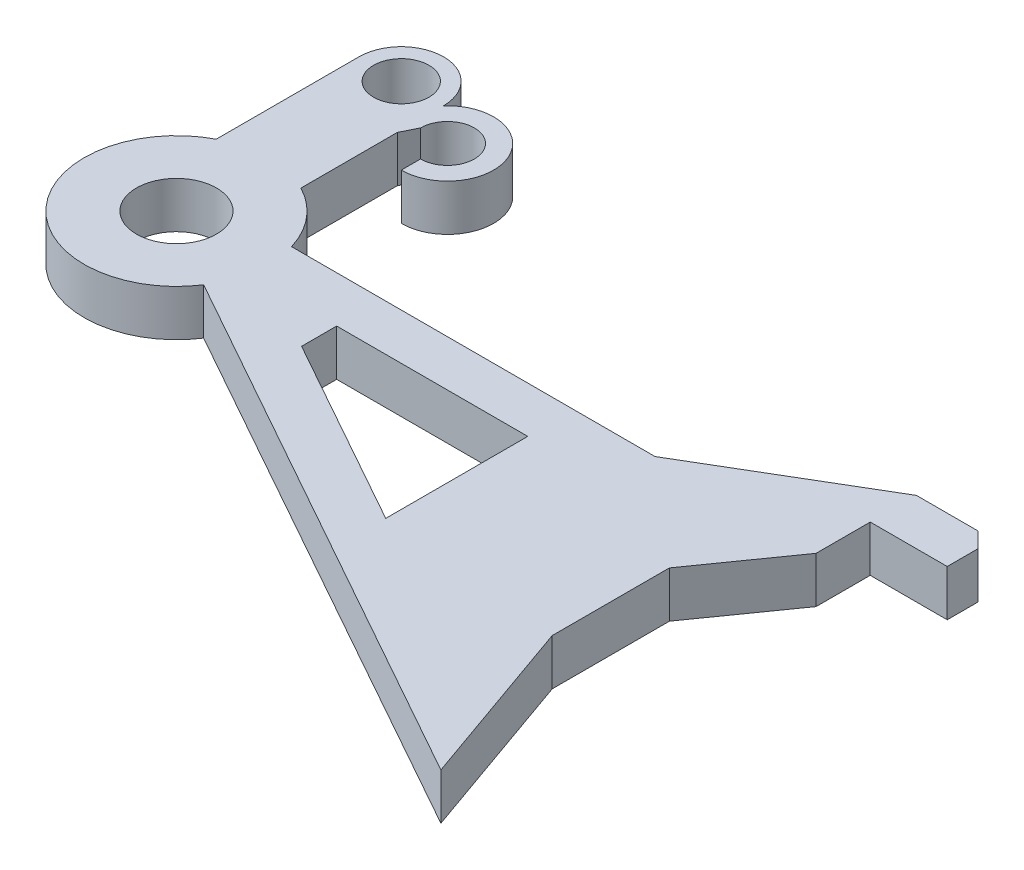
ISO-10303-21;
HEADER;
FILE_DESCRIPTION(('STEP AP214'),'2;1');
FILE_NAME('part.step','',(''),(''),'','','');
FILE_SCHEMA(('AUTOMOTIVE_DESIGN { 1 0 10303 214 1 1 1 1 }'));
ENDSEC;
DATA;
#1=APPLICATION_CONTEXT('core data for automotive mechanical design processes');
#2=APPLICATION_PROTOCOL_DEFINITION('international standard','automotive_design',2000,#1);
#3=PRODUCT_CONTEXT('',#1,'mechanical');
#4=PRODUCT('Part','Part','',(#3));
#5=PRODUCT_RELATED_PRODUCT_CATEGORY('part','',(#4));
#6=PRODUCT_DEFINITION_FORMATION('','',#4);
#7=PRODUCT_DEFINITION_CONTEXT('part definition',#1,'design');
#8=PRODUCT_DEFINITION('design','',#6,#7);
#9=PRODUCT_DEFINITION_SHAPE('','',#8);
#10=(LENGTH_UNIT() NAMED_UNIT(*) SI_UNIT(.MILLI.,.METRE.));
#11=(NAMED_UNIT(*) PLANE_ANGLE_UNIT() SI_UNIT($,.RADIAN.));
#12=(NAMED_UNIT(*) SI_UNIT($,.STERADIAN.) SOLID_ANGLE_UNIT());
#13=UNCERTAINTY_MEASURE_WITH_UNIT(LENGTH_MEASURE(1.E-05),#10,'distance_accuracy_value','');
#14=(GEOMETRIC_REPRESENTATION_CONTEXT(3) GLOBAL_UNCERTAINTY_ASSIGNED_CONTEXT((#13)) GLOBAL_UNIT_ASSIGNED_CONTEXT((#10,
#11,#12)) REPRESENTATION_CONTEXT('',''));
#15=CARTESIAN_POINT('',(0.,0.,0.));
#16=DIRECTION('',(0.,0.,1.));
#17=DIRECTION('',(1.,0.,0.));
#18=AXIS2_PLACEMENT_3D('',#15,#16,#17);
#19=CARTESIAN_POINT('',(0.,3.,0.));
#20=DIRECTION('',(0.,-1.,0.));
#21=DIRECTION('',(0.,0.,-1.));
#22=AXIS2_PLACEMENT_3D('',#19,#20,#21);
#23=CYLINDRICAL_SURFACE('',#22,6.);
#24=CARTESIAN_POINT('',(0.,3.,0.));
#25=DIRECTION('',(0.,1.,0.));
#26=DIRECTION('',(0.,0.,1.));
#27=AXIS2_PLACEMENT_3D('',#24,#25,#26);
#28=CIRCLE('',#27,6.);
#29=CARTESIAN_POINT('',(5.74415620551718,3.,-1.73339824812953));
#30=VERTEX_POINT('',#29);
#31=CARTESIAN_POINT('',(2.75,3.,-5.33268225192539));
#32=VERTEX_POINT('',#31);
#33=EDGE_CURVE('E249',#30,#32,#28,.T.);
#34=ORIENTED_EDGE('',*,*,#33,.F.);
#35=DIRECTION('',(0.,-1.,0.));
#36=VECTOR('',#35,1.);
#37=CARTESIAN_POINT('',(5.74415620551718,3.,-1.73339824812953));
#38=LINE('',#37,#36);
#39=CARTESIAN_POINT('',(5.74415620551718,0.,-1.73339824812953));
#40=VERTEX_POINT('',#39);
#41=EDGE_CURVE('E237',#30,#40,#38,.T.);
#42=ORIENTED_EDGE('',*,*,#41,.T.);
#43=CARTESIAN_POINT('',(0.,0.,0.));
#44=DIRECTION('',(0.,1.,0.));
#45=DIRECTION('',(0.,0.,1.));
#46=AXIS2_PLACEMENT_3D('',#43,#44,#45);
#47=CIRCLE('',#46,6.);
#48=CARTESIAN_POINT('',(2.75,0.,-5.33268225192539));
#49=VERTEX_POINT('',#48);
#50=EDGE_CURVE('E250',#40,#49,#47,.T.);
#51=ORIENTED_EDGE('',*,*,#50,.T.);
#52=DIRECTION('',(0.,1.,0.));
#53=VECTOR('',#52,1.);
#54=CARTESIAN_POINT('',(2.75,0.,-5.33268225192539));
#55=LINE('',#54,#53);
#56=EDGE_CURVE('E257',#49,#32,#55,.T.);
#57=ORIENTED_EDGE('',*,*,#56,.T.);
#58=EDGE_LOOP('',(#34,#42,#51,#57));
#59=FACE_BOUND('',#58,.T.);
#60=ADVANCED_FACE('F41',(#59),#23,.T.);
#61=CARTESIAN_POINT('',(2.75,0.,-14.6033539620353));
#62=DIRECTION('',(1.,0.,0.));
#63=DIRECTION('',(0.,0.,-1.));
#64=AXIS2_PLACEMENT_3D('',#61,#62,#63);
#65=PLANE('',#64);
#66=DIRECTION('',(0.,-1.,0.));
#67=VECTOR('',#66,1.);
#68=CARTESIAN_POINT('',(2.75,0.,-11.5953390831137));
#69=LINE('',#68,#67);
#70=CARTESIAN_POINT('',(2.75,3.,-11.5953390831137));
#71=VERTEX_POINT('',#70);
#72=CARTESIAN_POINT('',(2.75,0.,-11.5953390831137));
#73=VERTEX_POINT('',#72);
#74=EDGE_CURVE('E240',#71,#73,#69,.T.);
#75=ORIENTED_EDGE('',*,*,#74,.F.);
#76=DIRECTION('',(0.,0.,-1.));
#77=VECTOR('',#76,1.);
#78=CARTESIAN_POINT('',(2.75,3.,-14.6033539620353));
#79=LINE('',#78,#77);
#80=EDGE_CURVE('E277',#32,#71,#79,.T.);
#81=ORIENTED_EDGE('',*,*,#80,.F.);
#82=ORIENTED_EDGE('',*,*,#56,.F.);
#83=DIRECTION('',(0.,0.,-1.));
#84=VECTOR('',#83,1.);
#85=CARTESIAN_POINT('',(2.75,0.,-14.6033539620353));
#86=LINE('',#85,#84);
#87=EDGE_CURVE('E285',#49,#73,#86,.T.);
#88=ORIENTED_EDGE('',*,*,#87,.T.);
#89=EDGE_LOOP('',(#75,#81,#82,#88));
#90=FACE_BOUND('',#89,.T.);
#91=ADVANCED_FACE('F425',(#90),#65,.T.);
#92=CARTESIAN_POINT('',(0.,3.,0.));
#93=DIRECTION('',(0.,1.,0.));
#94=DIRECTION('',(0.,0.,1.));
#95=AXIS2_PLACEMENT_3D('',#92,#93,#94);
#96=PLANE('',#95);
#97=DIRECTION('',(0.,0.,1.));
#98=VECTOR('',#97,1.);
#99=CARTESIAN_POINT('',(11.6738185276408,3.,0.));
#100=LINE('',#99,#98);
#101=CARTESIAN_POINT('',(11.6738185276408,3.,1.26660175187046));
#102=VERTEX_POINT('',#101);
#103=CARTESIAN_POINT('',(11.6738185276408,3.,3.54547340621833));
#104=VERTEX_POINT('',#103);
#105=EDGE_CURVE('E218',#102,#104,#100,.T.);
#106=ORIENTED_EDGE('',*,*,#105,.F.);
#107=DIRECTION('',(-1.,0.,0.));
#108=VECTOR('',#107,1.);
#109=CARTESIAN_POINT('',(0.,3.,1.26660175187046));
#110=LINE('',#109,#108);
#111=CARTESIAN_POINT('',(24.087762842564,3.,1.26660175187046));
#112=VERTEX_POINT('',#111);
#113=EDGE_CURVE('E398',#112,#102,#110,.T.);
#114=ORIENTED_EDGE('',*,*,#113,.F.);
#115=DIRECTION('',(0.,0.,-1.));
#116=VECTOR('',#115,1.);
#117=CARTESIAN_POINT('',(24.087762842564,3.,0.));
#118=LINE('',#117,#116);
#119=CARTESIAN_POINT('',(24.087762842564,3.,10.493171470448));
#120=VERTEX_POINT('',#119);
#121=EDGE_CURVE('E400',#120,#112,#118,.T.);
#122=ORIENTED_EDGE('',*,*,#121,.F.);
#123=DIRECTION('',(0.872629175569452,0.,0.488383375991627));
#124=VECTOR('',#123,1.);
#125=CARTESIAN_POINT('',(1.27341831992451,3.,-2.27530672274524));
#126=LINE('',#125,#124);
#127=EDGE_CURVE('E402',#104,#120,#126,.T.);
#128=ORIENTED_EDGE('',*,*,#127,.F.);
#129=EDGE_LOOP('',(#106,#114,#122,#128));
#130=FACE_BOUND('',#129,.T.);
#131=DIRECTION('',(0.,0.,-1.));
#132=VECTOR('',#131,1.);
#133=CARTESIAN_POINT('',(45.031302406234,3.,-8.03788857701015));
#134=LINE('',#133,#132);
#135=CARTESIAN_POINT('',(45.0313024062341,3.,-5.03788857701015));
#136=VERTEX_POINT('',#135);
#137=CARTESIAN_POINT('',(45.031302406234,3.,-7.03788857701015));
#138=VERTEX_POINT('',#137);
#139=EDGE_CURVE('E350',#136,#138,#134,.T.);
#140=ORIENTED_EDGE('',*,*,#139,.T.);
#141=DIRECTION('',(0.70710678118655,0.,0.707106781186545));
#142=VECTOR('',#141,1.);
#143=CARTESIAN_POINT('',(26.0345954916219,3.,-26.0345954916221));
#144=LINE('',#143,#142);
#145=CARTESIAN_POINT('',(44.031302406234,3.,-8.03788857701015));
#146=VERTEX_POINT('',#145);
#147=EDGE_CURVE('E232',#138,#146,#144,.F.);
#148=ORIENTED_EDGE('',*,*,#147,.T.);
#149=DIRECTION('',(-1.,0.,0.));
#150=VECTOR('',#149,1.);
#151=CARTESIAN_POINT('',(40.0313024062341,3.,-8.03788857701015));
#152=LINE('',#151,#150);
#153=CARTESIAN_POINT('',(40.0313024062341,3.,-8.03788857701015));
#154=VERTEX_POINT('',#153);
#155=EDGE_CURVE('E348',#146,#154,#152,.T.);
#156=ORIENTED_EDGE('',*,*,#155,.T.);
#157=DIRECTION('',(-0.861032124321184,0.,0.508550568662498));
#158=VECTOR('',#157,1.);
#159=CARTESIAN_POINT('',(29.3571059051561,3.,-1.73339824812954));
#160=LINE('',#159,#158);
#161=CARTESIAN_POINT('',(29.3571059051561,3.,-1.73339824812954));
#162=VERTEX_POINT('',#161);
#163=EDGE_CURVE('E345',#154,#162,#160,.T.);
#164=ORIENTED_EDGE('',*,*,#163,.T.);
#165=DIRECTION('',(-1.,0.,0.));
#166=VECTOR('',#165,1.);
#167=CARTESIAN_POINT('',(29.3571059051561,3.,-1.73339824812954));
#168=LINE('',#167,#166);
#169=EDGE_CURVE('E342',#162,#30,#168,.T.);
#170=ORIENTED_EDGE('',*,*,#169,.T.);
#171=ORIENTED_EDGE('',*,*,#33,.T.);
#172=ORIENTED_EDGE('',*,*,#80,.T.);
#173=DIRECTION('',(0.44436211958122,0.,-0.895847256334072));
#174=VECTOR('',#173,1.);
#175=CARTESIAN_POINT('',(3.25,3.,-12.6033539620353));
#176=LINE('',#175,#174);
#177=CARTESIAN_POINT('',(3.25,3.,-12.6033539620353));
#178=VERTEX_POINT('',#177);
#179=EDGE_CURVE('E302',#71,#178,#176,.T.);
#180=ORIENTED_EDGE('',*,*,#179,.T.);
#181=CARTESIAN_POINT('',(5.,3.,-12.6033539620353));
#182=DIRECTION('',(0.,-1.,0.));
#183=DIRECTION('',(0.,0.,1.));
#184=AXIS2_PLACEMENT_3D('',#181,#182,#183);
#185=CIRCLE('',#184,1.75);
#186=CARTESIAN_POINT('',(5.,3.,-10.8533539620353));
#187=VERTEX_POINT('',#186);
#188=EDGE_CURVE('E310',#178,#187,#185,.T.);
#189=ORIENTED_EDGE('',*,*,#188,.T.);
#190=DIRECTION('',(0.,0.,1.));
#191=VECTOR('',#190,1.);
#192=CARTESIAN_POINT('',(5.,3.,-10.8533539620353));
#193=LINE('',#192,#191);
#194=CARTESIAN_POINT('',(5.,3.,-9.60335396203531));
#195=VERTEX_POINT('',#194);
#196=EDGE_CURVE('E307',#187,#195,#193,.T.);
#197=ORIENTED_EDGE('',*,*,#196,.T.);
#198=CARTESIAN_POINT('',(5.,3.,-12.6033539620353));
#199=DIRECTION('',(0.,1.,0.));
#200=DIRECTION('',(0.,0.,1.));
#201=AXIS2_PLACEMENT_3D('',#198,#199,#200);
#202=CIRCLE('',#201,3.);
#203=CARTESIAN_POINT('',(2.75,3.,-14.5876674453338));
#204=VERTEX_POINT('',#203);
#205=EDGE_CURVE('E305',#195,#204,#202,.T.);
#206=ORIENTED_EDGE('',*,*,#205,.T.);
#207=CARTESIAN_POINT('',(2.75,3.,-14.6033539620353));
#208=VERTEX_POINT('',#207);
#209=EDGE_CURVE('E280',#204,#208,#79,.T.);
#210=ORIENTED_EDGE('',*,*,#209,.T.);
#211=CARTESIAN_POINT('',(0.,3.,-14.6033539620353));
#212=DIRECTION('',(0.,1.,0.));
#213=DIRECTION('',(0.,0.,1.));
#214=AXIS2_PLACEMENT_3D('',#211,#212,#213);
#215=CIRCLE('',#214,2.75);
#216=CARTESIAN_POINT('',(-2.75,3.,-14.6033539620353));
#217=VERTEX_POINT('',#216);
#218=EDGE_CURVE('E274',#208,#217,#215,.T.);
#219=ORIENTED_EDGE('',*,*,#218,.T.);
#220=DIRECTION('',(0.,0.,1.));
#221=VECTOR('',#220,1.);
#222=CARTESIAN_POINT('',(-2.75,3.,-14.6033539620353));
#223=LINE('',#222,#221);
#224=CARTESIAN_POINT('',(-2.75,3.,-5.33268225192539));
#225=VERTEX_POINT('',#224);
#226=EDGE_CURVE('E271',#217,#225,#223,.T.);
#227=ORIENTED_EDGE('',*,*,#226,.T.);
#228=CARTESIAN_POINT('',(5.03282356085297,3.,3.26660175187047));
#229=VERTEX_POINT('',#228);
#230=EDGE_CURVE('E245',#225,#229,#28,.T.);
#231=ORIENTED_EDGE('',*,*,#230,.T.);
#232=DIRECTION('',(0.872629175569452,0.,0.488383375991627));
#233=VECTOR('',#232,1.);
#234=CARTESIAN_POINT('',(5.03282356085297,3.,3.26660175187047));
#235=LINE('',#234,#233);
#236=CARTESIAN_POINT('',(40.0313024062341,3.,22.8541605129268));
#237=VERTEX_POINT('',#236);
#238=EDGE_CURVE('E368',#229,#237,#235,.T.);
#239=ORIENTED_EDGE('',*,*,#238,.T.);
#240=DIRECTION('',(-0.332757416305651,0.,-0.943012461154988));
#241=VECTOR('',#240,1.);
#242=CARTESIAN_POINT('',(36.087762842564,3.,11.6784307849899));
#243=LINE('',#242,#241);
#244=CARTESIAN_POINT('',(36.087762842564,3.,11.6784307849899));
#245=VERTEX_POINT('',#244);
#246=EDGE_CURVE('E365',#237,#245,#243,.T.);
#247=ORIENTED_EDGE('',*,*,#246,.T.);
#248=DIRECTION('',(0.,0.,-1.));
#249=VECTOR('',#248,1.);
#250=CARTESIAN_POINT('',(36.087762842564,3.,4.06463985255777));
#251=LINE('',#250,#249);
#252=CARTESIAN_POINT('',(36.087762842564,3.,4.06463985255777));
#253=VERTEX_POINT('',#252);
#254=EDGE_CURVE('E362',#245,#253,#251,.T.);
#255=ORIENTED_EDGE('',*,*,#254,.T.);
#256=DIRECTION('',(0.576736198441861,0.,-0.816930448328883));
#257=VECTOR('',#256,1.);
#258=CARTESIAN_POINT('',(40.0313024062341,3.,-1.52127196025245));
#259=LINE('',#258,#257);
#260=CARTESIAN_POINT('',(40.0313024062341,3.,-1.52127196025245));
#261=VERTEX_POINT('',#260);
#262=EDGE_CURVE('E359',#253,#261,#259,.T.);
#263=ORIENTED_EDGE('',*,*,#262,.T.);
#264=DIRECTION('',(0.,0.,-1.));
#265=VECTOR('',#264,1.);
#266=CARTESIAN_POINT('',(40.0313024062341,3.,-5.03788857701015));
#267=LINE('',#266,#265);
#268=CARTESIAN_POINT('',(40.0313024062341,3.,-5.03788857701015));
#269=VERTEX_POINT('',#268);
#270=EDGE_CURVE('E356',#261,#269,#267,.T.);
#271=ORIENTED_EDGE('',*,*,#270,.T.);
#272=DIRECTION('',(1.,0.,0.));
#273=VECTOR('',#272,1.);
#274=CARTESIAN_POINT('',(40.0313024062341,3.,-5.03788857701015));
#275=LINE('',#274,#273);
#276=EDGE_CURVE('E353',#269,#136,#275,.T.);
#277=ORIENTED_EDGE('',*,*,#276,.T.);
#278=EDGE_LOOP('',(#140,#148,#156,#164,#170,#171,#172,#180,#189,#197,#206,#210,#219,#227,#231,
#239,#247,#255,#263,#271,#277));
#279=FACE_BOUND('',#278,.T.);
#280=CARTESIAN_POINT('',(0.,3.,0.));
#281=DIRECTION('',(0.,1.,0.));
#282=DIRECTION('',(0.,0.,1.));
#283=AXIS2_PLACEMENT_3D('',#280,#281,#282);
#284=CIRCLE('',#283,2.6);
#285=CARTESIAN_POINT('',(0.,3.,2.6));
#286=VERTEX_POINT('',#285);
#287=EDGE_CURVE('E256',#286,#286,#284,.T.);
#288=ORIENTED_EDGE('',*,*,#287,.F.);
#289=EDGE_LOOP('',(#288));
#290=FACE_BOUND('',#289,.T.);
#291=CARTESIAN_POINT('',(0.,3.,-14.6033539620353));
#292=DIRECTION('',(0.,1.,0.));
#293=DIRECTION('',(0.,0.,1.));
#294=AXIS2_PLACEMENT_3D('',#291,#292,#293);
#295=CIRCLE('',#294,1.8);
#296=CARTESIAN_POINT('',(0.,3.,-12.8033539620353));
#297=VERTEX_POINT('',#296);
#298=EDGE_CURVE('E288',#297,#297,#295,.T.);
#299=ORIENTED_EDGE('',*,*,#298,.F.);
#300=EDGE_LOOP('',(#299));
#301=FACE_BOUND('',#300,.T.);
#302=ADVANCED_FACE('F410',(#130,#279,#290,#301),#96,.T.);
#303=CARTESIAN_POINT('',(0.,0.,0.));
#304=DIRECTION('',(0.,1.,0.));
#305=DIRECTION('',(0.,0.,1.));
#306=AXIS2_PLACEMENT_3D('',#303,#304,#305);
#307=PLANE('',#306);
#308=DIRECTION('',(-1.,0.,0.));
#309=VECTOR('',#308,1.);
#310=CARTESIAN_POINT('',(0.,0.,1.26660175187046));
#311=LINE('',#310,#309);
#312=CARTESIAN_POINT('',(24.087762842564,0.,1.26660175187046));
#313=VERTEX_POINT('',#312);
#314=CARTESIAN_POINT('',(11.6738185276408,0.,1.26660175187046));
#315=VERTEX_POINT('',#314);
#316=EDGE_CURVE('E50',#313,#315,#311,.T.);
#317=ORIENTED_EDGE('',*,*,#316,.T.);
#318=DIRECTION('',(0.,0.,1.));
#319=VECTOR('',#318,1.);
#320=CARTESIAN_POINT('',(11.6738185276408,0.,0.));
#321=LINE('',#320,#319);
#322=CARTESIAN_POINT('',(11.6738185276408,0.,3.54547340621833));
#323=VERTEX_POINT('',#322);
#324=EDGE_CURVE('E11',#315,#323,#321,.T.);
#325=ORIENTED_EDGE('',*,*,#324,.T.);
#326=DIRECTION('',(0.872629175569452,0.,0.488383375991627));
#327=VECTOR('',#326,1.);
#328=CARTESIAN_POINT('',(1.27341831992451,0.,-2.27530672274524));
#329=LINE('',#328,#327);
#330=CARTESIAN_POINT('',(24.087762842564,0.,10.493171470448));
#331=VERTEX_POINT('',#330);
#332=EDGE_CURVE('E206',#323,#331,#329,.T.);
#333=ORIENTED_EDGE('',*,*,#332,.T.);
#334=DIRECTION('',(0.,0.,-1.));
#335=VECTOR('',#334,1.);
#336=CARTESIAN_POINT('',(24.087762842564,0.,0.));
#337=LINE('',#336,#335);
#338=EDGE_CURVE('E210',#331,#313,#337,.T.);
#339=ORIENTED_EDGE('',*,*,#338,.T.);
#340=EDGE_LOOP('',(#317,#325,#333,#339));
#341=FACE_BOUND('',#340,.T.);
#342=DIRECTION('',(-1.,0.,0.));
#343=VECTOR('',#342,1.);
#344=CARTESIAN_POINT('',(40.0313024062341,0.,-8.03788857701015));
#345=LINE('',#344,#343);
#346=CARTESIAN_POINT('',(44.031302406234,0.,-8.03788857701015));
#347=VERTEX_POINT('',#346);
#348=CARTESIAN_POINT('',(40.0313024062341,0.,-8.03788857701015));
#349=VERTEX_POINT('',#348);
#350=EDGE_CURVE('E375',#347,#349,#345,.T.);
#351=ORIENTED_EDGE('',*,*,#350,.F.);
#352=DIRECTION('',(-0.70710678118655,0.,-0.707106781186545));
#353=VECTOR('',#352,1.);
#354=CARTESIAN_POINT('',(45.031302406234,0.,-7.03788857701015));
#355=LINE('',#354,#353);
#356=CARTESIAN_POINT('',(45.031302406234,0.,-7.03788857701015));
#357=VERTEX_POINT('',#356);
#358=EDGE_CURVE('E211',#347,#357,#355,.F.);
#359=ORIENTED_EDGE('',*,*,#358,.T.);
#360=DIRECTION('',(0.,0.,-1.));
#361=VECTOR('',#360,1.);
#362=CARTESIAN_POINT('',(45.031302406234,0.,-8.03788857701015));
#363=LINE('',#362,#361);
#364=CARTESIAN_POINT('',(45.0313024062341,0.,-5.03788857701015));
#365=VERTEX_POINT('',#364);
#366=EDGE_CURVE('E377',#365,#357,#363,.T.);
#367=ORIENTED_EDGE('',*,*,#366,.F.);
#368=DIRECTION('',(1.,0.,0.));
#369=VECTOR('',#368,1.);
#370=CARTESIAN_POINT('',(40.0313024062341,0.,-5.03788857701015));
#371=LINE('',#370,#369);
#372=CARTESIAN_POINT('',(40.0313024062341,0.,-5.03788857701015));
#373=VERTEX_POINT('',#372);
#374=EDGE_CURVE('E380',#373,#365,#371,.T.);
#375=ORIENTED_EDGE('',*,*,#374,.F.);
#376=DIRECTION('',(0.,0.,-1.));
#377=VECTOR('',#376,1.);
#378=CARTESIAN_POINT('',(40.0313024062341,0.,-5.03788857701015));
#379=LINE('',#378,#377);
#380=CARTESIAN_POINT('',(40.0313024062341,0.,-1.52127196025245));
#381=VERTEX_POINT('',#380);
#382=EDGE_CURVE('E383',#381,#373,#379,.T.);
#383=ORIENTED_EDGE('',*,*,#382,.F.);
#384=DIRECTION('',(0.576736198441861,0.,-0.816930448328883));
#385=VECTOR('',#384,1.);
#386=CARTESIAN_POINT('',(40.0313024062341,0.,-1.52127196025245));
#387=LINE('',#386,#385);
#388=CARTESIAN_POINT('',(36.087762842564,0.,4.06463985255777));
#389=VERTEX_POINT('',#388);
#390=EDGE_CURVE('E386',#389,#381,#387,.T.);
#391=ORIENTED_EDGE('',*,*,#390,.F.);
#392=DIRECTION('',(0.,0.,-1.));
#393=VECTOR('',#392,1.);
#394=CARTESIAN_POINT('',(36.087762842564,0.,4.06463985255777));
#395=LINE('',#394,#393);
#396=CARTESIAN_POINT('',(36.087762842564,0.,11.6784307849899));
#397=VERTEX_POINT('',#396);
#398=EDGE_CURVE('E389',#397,#389,#395,.T.);
#399=ORIENTED_EDGE('',*,*,#398,.F.);
#400=DIRECTION('',(-0.332757416305651,0.,-0.943012461154988));
#401=VECTOR('',#400,1.);
#402=CARTESIAN_POINT('',(36.087762842564,0.,11.6784307849899));
#403=LINE('',#402,#401);
#404=CARTESIAN_POINT('',(40.0313024062341,0.,22.8541605129268));
#405=VERTEX_POINT('',#404);
#406=EDGE_CURVE('E392',#405,#397,#403,.T.);
#407=ORIENTED_EDGE('',*,*,#406,.F.);
#408=DIRECTION('',(0.872629175569452,0.,0.488383375991627));
#409=VECTOR('',#408,1.);
#410=CARTESIAN_POINT('',(5.03282356085297,0.,3.26660175187047));
#411=LINE('',#410,#409);
#412=CARTESIAN_POINT('',(5.03282356085297,0.,3.26660175187047));
#413=VERTEX_POINT('',#412);
#414=EDGE_CURVE('E344',#413,#405,#411,.T.);
#415=ORIENTED_EDGE('',*,*,#414,.F.);
#416=CARTESIAN_POINT('',(-2.75,0.,-5.33268225192539));
#417=VERTEX_POINT('',#416);
#418=EDGE_CURVE('E246',#417,#413,#47,.T.);
#419=ORIENTED_EDGE('',*,*,#418,.F.);
#420=DIRECTION('',(0.,0.,1.));
#421=VECTOR('',#420,1.);
#422=CARTESIAN_POINT('',(-2.75,0.,-14.6033539620353));
#423=LINE('',#422,#421);
#424=CARTESIAN_POINT('',(-2.75,0.,-14.6033539620353));
#425=VERTEX_POINT('',#424);
#426=EDGE_CURVE('E264',#425,#417,#423,.T.);
#427=ORIENTED_EDGE('',*,*,#426,.F.);
#428=CARTESIAN_POINT('',(0.,0.,-14.6033539620353));
#429=DIRECTION('',(0.,1.,0.));
#430=DIRECTION('',(0.,0.,1.));
#431=AXIS2_PLACEMENT_3D('',#428,#429,#430);
#432=CIRCLE('',#431,2.75);
#433=CARTESIAN_POINT('',(2.75,0.,-14.6033539620353));
#434=VERTEX_POINT('',#433);
#435=EDGE_CURVE('E282',#434,#425,#432,.T.);
#436=ORIENTED_EDGE('',*,*,#435,.F.);
#437=CARTESIAN_POINT('',(2.75,0.,-14.5876674453338));
#438=VERTEX_POINT('',#437);
#439=EDGE_CURVE('E273',#438,#434,#86,.T.);
#440=ORIENTED_EDGE('',*,*,#439,.F.);
#441=CARTESIAN_POINT('',(5.,0.,-12.6033539620353));
#442=DIRECTION('',(0.,1.,0.));
#443=DIRECTION('',(0.,0.,1.));
#444=AXIS2_PLACEMENT_3D('',#441,#442,#443);
#445=CIRCLE('',#444,3.);
#446=CARTESIAN_POINT('',(5.,0.,-9.60335396203531));
#447=VERTEX_POINT('',#446);
#448=EDGE_CURVE('E315',#447,#438,#445,.T.);
#449=ORIENTED_EDGE('',*,*,#448,.F.);
#450=DIRECTION('',(0.,0.,1.));
#451=VECTOR('',#450,1.);
#452=CARTESIAN_POINT('',(5.,0.,-10.8533539620353));
#453=LINE('',#452,#451);
#454=CARTESIAN_POINT('',(5.,0.,-10.8533539620353));
#455=VERTEX_POINT('',#454);
#456=EDGE_CURVE('E317',#455,#447,#453,.T.);
#457=ORIENTED_EDGE('',*,*,#456,.F.);
#458=CARTESIAN_POINT('',(5.,0.,-12.6033539620353));
#459=DIRECTION('',(0.,-1.,0.));
#460=DIRECTION('',(0.,0.,1.));
#461=AXIS2_PLACEMENT_3D('',#458,#459,#460);
#462=CIRCLE('',#461,1.75);
#463=CARTESIAN_POINT('',(3.25,0.,-12.6033539620353));
#464=VERTEX_POINT('',#463);
#465=EDGE_CURVE('E304',#464,#455,#462,.T.);
#466=ORIENTED_EDGE('',*,*,#465,.F.);
#467=DIRECTION('',(0.44436211958122,0.,-0.895847256334072));
#468=VECTOR('',#467,1.);
#469=CARTESIAN_POINT('',(3.25,0.,-12.6033539620353));
#470=LINE('',#469,#468);
#471=EDGE_CURVE('E298',#73,#464,#470,.T.);
#472=ORIENTED_EDGE('',*,*,#471,.F.);
#473=ORIENTED_EDGE('',*,*,#87,.F.);
#474=ORIENTED_EDGE('',*,*,#50,.F.);
#475=DIRECTION('',(-1.,0.,0.));
#476=VECTOR('',#475,1.);
#477=CARTESIAN_POINT('',(29.3571059051561,0.,-1.73339824812954));
#478=LINE('',#477,#476);
#479=CARTESIAN_POINT('',(29.3571059051561,0.,-1.73339824812954));
#480=VERTEX_POINT('',#479);
#481=EDGE_CURVE('E326',#480,#40,#478,.T.);
#482=ORIENTED_EDGE('',*,*,#481,.F.);
#483=DIRECTION('',(-0.861032124321184,0.,0.508550568662498));
#484=VECTOR('',#483,1.);
#485=CARTESIAN_POINT('',(29.3571059051561,0.,-1.73339824812954));
#486=LINE('',#485,#484);
#487=EDGE_CURVE('E372',#349,#480,#486,.T.);
#488=ORIENTED_EDGE('',*,*,#487,.F.);
#489=EDGE_LOOP('',(#351,#359,#367,#375,#383,#391,#399,#407,#415,#419,#427,#436,#440,#449,#457,
#466,#472,#473,#474,#482,#488));
#490=FACE_BOUND('',#489,.T.);
#491=CARTESIAN_POINT('',(0.,0.,0.));
#492=DIRECTION('',(0.,1.,0.));
#493=DIRECTION('',(0.,0.,1.));
#494=AXIS2_PLACEMENT_3D('',#491,#492,#493);
#495=CIRCLE('',#494,2.6);
#496=CARTESIAN_POINT('',(0.,0.,2.6));
#497=VERTEX_POINT('',#496);
#498=EDGE_CURVE('E253',#497,#497,#495,.T.);
#499=ORIENTED_EDGE('',*,*,#498,.T.);
#500=EDGE_LOOP('',(#499));
#501=FACE_BOUND('',#500,.T.);
#502=CARTESIAN_POINT('',(0.,0.,-14.6033539620353));
#503=DIRECTION('',(0.,1.,0.));
#504=DIRECTION('',(0.,0.,1.));
#505=AXIS2_PLACEMENT_3D('',#502,#503,#504);
#506=CIRCLE('',#505,1.8);
#507=CARTESIAN_POINT('',(0.,0.,-12.8033539620353));
#508=VERTEX_POINT('',#507);
#509=EDGE_CURVE('E291',#508,#508,#506,.T.);
#510=ORIENTED_EDGE('',*,*,#509,.T.);
#511=EDGE_LOOP('',(#510));
#512=FACE_BOUND('',#511,.T.);
#513=ADVANCED_FACE('F222',(#341,#490,#501,#512),#307,.F.);
#514=ORIENTED_EDGE('',*,*,#418,.T.);
#515=DIRECTION('',(0.,1.,0.));
#516=VECTOR('',#515,1.);
#517=CARTESIAN_POINT('',(5.03282356085297,0.,3.26660175187047));
#518=LINE('',#517,#516);
#519=EDGE_CURVE('E322',#413,#229,#518,.T.);
#520=ORIENTED_EDGE('',*,*,#519,.T.);
#521=ORIENTED_EDGE('',*,*,#230,.F.);
#522=DIRECTION('',(0.,1.,0.));
#523=VECTOR('',#522,1.);
#524=CARTESIAN_POINT('',(-2.75,0.,-5.33268225192539));
#525=LINE('',#524,#523);
#526=EDGE_CURVE('E266',#417,#225,#525,.T.);
#527=ORIENTED_EDGE('',*,*,#526,.F.);
#528=EDGE_LOOP('',(#514,#520,#521,#527));
#529=FACE_BOUND('',#528,.T.);
#530=ADVANCED_FACE('F427',(#529),#23,.T.);
#531=CARTESIAN_POINT('',(0.,3.,0.));
#532=DIRECTION('',(0.,-1.,0.));
#533=DIRECTION('',(0.,0.,-1.));
#534=AXIS2_PLACEMENT_3D('',#531,#532,#533);
#535=CYLINDRICAL_SURFACE('',#534,2.6);
#536=ORIENTED_EDGE('',*,*,#287,.T.);
#537=EDGE_LOOP('',(#536));
#538=FACE_BOUND('',#537,.T.);
#539=ORIENTED_EDGE('',*,*,#498,.F.);
#540=EDGE_LOOP('',(#539));
#541=FACE_BOUND('',#540,.T.);
#542=ADVANCED_FACE('F437',(#538,#541),#535,.F.);
#543=DIRECTION('',(0.,1.,0.));
#544=VECTOR('',#543,1.);
#545=CARTESIAN_POINT('',(2.75,0.,-14.5876674453338));
#546=LINE('',#545,#544);
#547=EDGE_CURVE('E242',#438,#204,#546,.T.);
#548=ORIENTED_EDGE('',*,*,#547,.F.);
#549=ORIENTED_EDGE('',*,*,#439,.T.);
#550=DIRECTION('',(0.,1.,0.));
#551=VECTOR('',#550,1.);
#552=CARTESIAN_POINT('',(2.75,0.,-14.6033539620353));
#553=LINE('',#552,#551);
#554=EDGE_CURVE('E260',#434,#208,#553,.T.);
#555=ORIENTED_EDGE('',*,*,#554,.T.);
#556=ORIENTED_EDGE('',*,*,#209,.F.);
#557=EDGE_LOOP('',(#548,#549,#555,#556));
#558=FACE_BOUND('',#557,.T.);
#559=ADVANCED_FACE('F433',(#558),#65,.T.);
#560=CARTESIAN_POINT('',(-2.75,0.,-14.6033539620353));
#561=DIRECTION('',(-1.,0.,0.));
#562=DIRECTION('',(0.,0.,1.));
#563=AXIS2_PLACEMENT_3D('',#560,#561,#562);
#564=PLANE('',#563);
#565=ORIENTED_EDGE('',*,*,#226,.F.);
#566=DIRECTION('',(0.,1.,0.));
#567=VECTOR('',#566,1.);
#568=CARTESIAN_POINT('',(-2.75,0.,-14.6033539620353));
#569=LINE('',#568,#567);
#570=EDGE_CURVE('E263',#425,#217,#569,.T.);
#571=ORIENTED_EDGE('',*,*,#570,.F.);
#572=ORIENTED_EDGE('',*,*,#426,.T.);
#573=ORIENTED_EDGE('',*,*,#526,.T.);
#574=EDGE_LOOP('',(#565,#571,#572,#573));
#575=FACE_BOUND('',#574,.T.);
#576=ADVANCED_FACE('F462',(#575),#564,.T.);
#577=CARTESIAN_POINT('',(0.,0.,-14.6033539620353));
#578=DIRECTION('',(0.,1.,0.));
#579=DIRECTION('',(0.,0.,1.));
#580=AXIS2_PLACEMENT_3D('',#577,#578,#579);
#581=CYLINDRICAL_SURFACE('',#580,2.75);
#582=ORIENTED_EDGE('',*,*,#218,.F.);
#583=ORIENTED_EDGE('',*,*,#554,.F.);
#584=ORIENTED_EDGE('',*,*,#435,.T.);
#585=ORIENTED_EDGE('',*,*,#570,.T.);
#586=EDGE_LOOP('',(#582,#583,#584,#585));
#587=FACE_BOUND('',#586,.T.);
#588=ADVANCED_FACE('F464',(#587),#581,.T.);
#589=CARTESIAN_POINT('',(0.,0.,-14.6033539620353));
#590=DIRECTION('',(0.,1.,0.));
#591=DIRECTION('',(0.,0.,1.));
#592=AXIS2_PLACEMENT_3D('',#589,#590,#591);
#593=CYLINDRICAL_SURFACE('',#592,1.8);
#594=ORIENTED_EDGE('',*,*,#509,.F.);
#595=EDGE_LOOP('',(#594));
#596=FACE_BOUND('',#595,.T.);
#597=ORIENTED_EDGE('',*,*,#298,.T.);
#598=EDGE_LOOP('',(#597));
#599=FACE_BOUND('',#598,.T.);
#600=ADVANCED_FACE('F547',(#596,#599),#593,.F.);
#601=CARTESIAN_POINT('',(5.,0.,-12.6033539620353));
#602=DIRECTION('',(0.,1.,0.));
#603=DIRECTION('',(0.,0.,1.));
#604=AXIS2_PLACEMENT_3D('',#601,#602,#603);
#605=CYLINDRICAL_SURFACE('',#604,1.75);
#606=ORIENTED_EDGE('',*,*,#188,.F.);
#607=DIRECTION('',(0.,1.,0.));
#608=VECTOR('',#607,1.);
#609=CARTESIAN_POINT('',(3.25,0.,-12.6033539620353));
#610=LINE('',#609,#608);
#611=EDGE_CURVE('E292',#464,#178,#610,.T.);
#612=ORIENTED_EDGE('',*,*,#611,.F.);
#613=ORIENTED_EDGE('',*,*,#465,.T.);
#614=DIRECTION('',(0.,1.,0.));
#615=VECTOR('',#614,1.);
#616=CARTESIAN_POINT('',(5.,0.,-10.8533539620353));
#617=LINE('',#616,#615);
#618=EDGE_CURVE('E295',#455,#187,#617,.T.);
#619=ORIENTED_EDGE('',*,*,#618,.T.);
#620=EDGE_LOOP('',(#606,#612,#613,#619));
#621=FACE_BOUND('',#620,.T.);
#622=ADVANCED_FACE('F483',(#621),#605,.F.);
#623=CARTESIAN_POINT('',(3.25,0.,-12.6033539620353));
#624=DIRECTION('',(0.895847256334072,0.,0.44436211958122));
#625=DIRECTION('',(0.44436211958122,0.,-0.895847256334073));
#626=AXIS2_PLACEMENT_3D('',#623,#624,#625);
#627=PLANE('',#626);
#628=ORIENTED_EDGE('',*,*,#179,.F.);
#629=ORIENTED_EDGE('',*,*,#74,.T.);
#630=ORIENTED_EDGE('',*,*,#471,.T.);
#631=ORIENTED_EDGE('',*,*,#611,.T.);
#632=EDGE_LOOP('',(#628,#629,#630,#631));
#633=FACE_BOUND('',#632,.T.);
#634=ADVANCED_FACE('F485',(#633),#627,.T.);
#635=CARTESIAN_POINT('',(5.,0.,-12.6033539620353));
#636=DIRECTION('',(0.,1.,0.));
#637=DIRECTION('',(0.,0.,1.));
#638=AXIS2_PLACEMENT_3D('',#635,#636,#637);
#639=CYLINDRICAL_SURFACE('',#638,3.);
#640=ORIENTED_EDGE('',*,*,#448,.T.);
#641=ORIENTED_EDGE('',*,*,#547,.T.);
#642=ORIENTED_EDGE('',*,*,#205,.F.);
#643=DIRECTION('',(0.,1.,0.));
#644=VECTOR('',#643,1.);
#645=CARTESIAN_POINT('',(5.,0.,-9.60335396203531));
#646=LINE('',#645,#644);
#647=EDGE_CURVE('E297',#447,#195,#646,.T.);
#648=ORIENTED_EDGE('',*,*,#647,.F.);
#649=EDGE_LOOP('',(#640,#641,#642,#648));
#650=FACE_BOUND('',#649,.T.);
#651=ADVANCED_FACE('F474',(#650),#639,.T.);
#652=CARTESIAN_POINT('',(5.,0.,-10.8533539620353));
#653=DIRECTION('',(-1.,0.,0.));
#654=DIRECTION('',(0.,0.,1.));
#655=AXIS2_PLACEMENT_3D('',#652,#653,#654);
#656=PLANE('',#655);
#657=ORIENTED_EDGE('',*,*,#196,.F.);
#658=ORIENTED_EDGE('',*,*,#618,.F.);
#659=ORIENTED_EDGE('',*,*,#456,.T.);
#660=ORIENTED_EDGE('',*,*,#647,.T.);
#661=EDGE_LOOP('',(#657,#658,#659,#660));
#662=FACE_BOUND('',#661,.T.);
#663=ADVANCED_FACE('F477',(#662),#656,.T.);
#664=CARTESIAN_POINT('',(29.3571059051561,0.,-1.73339824812954));
#665=DIRECTION('',(0.,0.,-1.));
#666=DIRECTION('',(-1.,0.,0.));
#667=AXIS2_PLACEMENT_3D('',#664,#665,#666);
#668=PLANE('',#667);
#669=ORIENTED_EDGE('',*,*,#41,.F.);
#670=ORIENTED_EDGE('',*,*,#169,.F.);
#671=DIRECTION('',(0.,1.,0.));
#672=VECTOR('',#671,1.);
#673=CARTESIAN_POINT('',(29.3571059051561,0.,-1.73339824812954));
#674=LINE('',#673,#672);
#675=EDGE_CURVE('E313',#480,#162,#674,.T.);
#676=ORIENTED_EDGE('',*,*,#675,.F.);
#677=ORIENTED_EDGE('',*,*,#481,.T.);
#678=EDGE_LOOP('',(#669,#670,#676,#677));
#679=FACE_BOUND('',#678,.T.);
#680=ADVANCED_FACE('F495',(#679),#668,.T.);
#681=CARTESIAN_POINT('',(29.3571059051561,0.,-1.73339824812954));
#682=DIRECTION('',(-0.508550568662498,0.,-0.861032124321184));
#683=DIRECTION('',(-0.861032124321184,0.,0.508550568662498));
#684=AXIS2_PLACEMENT_3D('',#681,#682,#683);
#685=PLANE('',#684);
#686=ORIENTED_EDGE('',*,*,#163,.F.);
#687=DIRECTION('',(0.,1.,0.));
#688=VECTOR('',#687,1.);
#689=CARTESIAN_POINT('',(40.0313024062341,0.,-8.03788857701015));
#690=LINE('',#689,#688);
#691=EDGE_CURVE('E338',#349,#154,#690,.T.);
#692=ORIENTED_EDGE('',*,*,#691,.F.);
#693=ORIENTED_EDGE('',*,*,#487,.T.);
#694=ORIENTED_EDGE('',*,*,#675,.T.);
#695=EDGE_LOOP('',(#686,#692,#693,#694));
#696=FACE_BOUND('',#695,.T.);
#697=ADVANCED_FACE('F500',(#696),#685,.T.);
#698=CARTESIAN_POINT('',(40.0313024062341,0.,-8.03788857701015));
#699=DIRECTION('',(0.,0.,-1.));
#700=DIRECTION('',(-1.,0.,0.));
#701=AXIS2_PLACEMENT_3D('',#698,#699,#700);
#702=PLANE('',#701);
#703=ORIENTED_EDGE('',*,*,#155,.F.);
#704=DIRECTION('',(0.,-1.,0.));
#705=VECTOR('',#704,1.);
#706=CARTESIAN_POINT('',(44.031302406234,0.,-8.03788857701015));
#707=LINE('',#706,#705);
#708=EDGE_CURVE('E230',#146,#347,#707,.T.);
#709=ORIENTED_EDGE('',*,*,#708,.T.);
#710=ORIENTED_EDGE('',*,*,#350,.T.);
#711=ORIENTED_EDGE('',*,*,#691,.T.);
#712=EDGE_LOOP('',(#703,#709,#710,#711));
#713=FACE_BOUND('',#712,.T.);
#714=ADVANCED_FACE('F503',(#713),#702,.T.);
#715=CARTESIAN_POINT('',(45.031302406234,0.,-8.03788857701015));
#716=DIRECTION('',(1.,0.,0.));
#717=DIRECTION('',(0.,0.,-1.));
#718=AXIS2_PLACEMENT_3D('',#715,#716,#717);
#719=PLANE('',#718);
#720=ORIENTED_EDGE('',*,*,#366,.T.);
#721=DIRECTION('',(0.,1.,0.));
#722=VECTOR('',#721,1.);
#723=CARTESIAN_POINT('',(45.031302406234,0.,-7.03788857701015));
#724=LINE('',#723,#722);
#725=EDGE_CURVE('E234',#357,#138,#724,.T.);
#726=ORIENTED_EDGE('',*,*,#725,.T.);
#727=ORIENTED_EDGE('',*,*,#139,.F.);
#728=DIRECTION('',(0.,1.,0.));
#729=VECTOR('',#728,1.);
#730=CARTESIAN_POINT('',(45.0313024062341,0.,-5.03788857701015));
#731=LINE('',#730,#729);
#732=EDGE_CURVE('E336',#365,#136,#731,.T.);
#733=ORIENTED_EDGE('',*,*,#732,.F.);
#734=EDGE_LOOP('',(#720,#726,#727,#733));
#735=FACE_BOUND('',#734,.T.);
#736=ADVANCED_FACE('F511',(#735),#719,.T.);
#737=CARTESIAN_POINT('',(40.0313024062341,0.,-5.03788857701015));
#738=DIRECTION('',(0.,0.,1.));
#739=DIRECTION('',(1.,0.,0.));
#740=AXIS2_PLACEMENT_3D('',#737,#738,#739);
#741=PLANE('',#740);
#742=ORIENTED_EDGE('',*,*,#276,.F.);
#743=DIRECTION('',(0.,1.,0.));
#744=VECTOR('',#743,1.);
#745=CARTESIAN_POINT('',(40.0313024062341,0.,-5.03788857701015));
#746=LINE('',#745,#744);
#747=EDGE_CURVE('E334',#373,#269,#746,.T.);
#748=ORIENTED_EDGE('',*,*,#747,.F.);
#749=ORIENTED_EDGE('',*,*,#374,.T.);
#750=ORIENTED_EDGE('',*,*,#732,.T.);
#751=EDGE_LOOP('',(#742,#748,#749,#750));
#752=FACE_BOUND('',#751,.T.);
#753=ADVANCED_FACE('F515',(#752),#741,.T.);
#754=CARTESIAN_POINT('',(40.0313024062341,0.,-5.03788857701015));
#755=DIRECTION('',(1.,0.,0.));
#756=DIRECTION('',(0.,0.,-1.));
#757=AXIS2_PLACEMENT_3D('',#754,#755,#756);
#758=PLANE('',#757);
#759=ORIENTED_EDGE('',*,*,#270,.F.);
#760=DIRECTION('',(0.,1.,0.));
#761=VECTOR('',#760,1.);
#762=CARTESIAN_POINT('',(40.0313024062341,0.,-1.52127196025245));
#763=LINE('',#762,#761);
#764=EDGE_CURVE('E332',#381,#261,#763,.T.);
#765=ORIENTED_EDGE('',*,*,#764,.F.);
#766=ORIENTED_EDGE('',*,*,#382,.T.);
#767=ORIENTED_EDGE('',*,*,#747,.T.);
#768=EDGE_LOOP('',(#759,#765,#766,#767));
#769=FACE_BOUND('',#768,.T.);
#770=ADVANCED_FACE('F520',(#769),#758,.T.);
#771=CARTESIAN_POINT('',(40.0313024062341,0.,-1.52127196025245));
#772=DIRECTION('',(0.816930448328883,0.,0.576736198441861));
#773=DIRECTION('',(0.576736198441861,0.,-0.816930448328883));
#774=AXIS2_PLACEMENT_3D('',#771,#772,#773);
#775=PLANE('',#774);
#776=ORIENTED_EDGE('',*,*,#262,.F.);
#777=DIRECTION('',(0.,1.,0.));
#778=VECTOR('',#777,1.);
#779=CARTESIAN_POINT('',(36.087762842564,0.,4.06463985255777));
#780=LINE('',#779,#778);
#781=EDGE_CURVE('E330',#389,#253,#780,.T.);
#782=ORIENTED_EDGE('',*,*,#781,.F.);
#783=ORIENTED_EDGE('',*,*,#390,.T.);
#784=ORIENTED_EDGE('',*,*,#764,.T.);
#785=EDGE_LOOP('',(#776,#782,#783,#784));
#786=FACE_BOUND('',#785,.T.);
#787=ADVANCED_FACE('F523',(#786),#775,.T.);
#788=CARTESIAN_POINT('',(36.087762842564,0.,4.06463985255777));
#789=DIRECTION('',(1.,0.,0.));
#790=DIRECTION('',(0.,0.,-1.));
#791=AXIS2_PLACEMENT_3D('',#788,#789,#790);
#792=PLANE('',#791);
#793=ORIENTED_EDGE('',*,*,#254,.F.);
#794=DIRECTION('',(0.,1.,0.));
#795=VECTOR('',#794,1.);
#796=CARTESIAN_POINT('',(36.087762842564,0.,11.6784307849899));
#797=LINE('',#796,#795);
#798=EDGE_CURVE('E328',#397,#245,#797,.T.);
#799=ORIENTED_EDGE('',*,*,#798,.F.);
#800=ORIENTED_EDGE('',*,*,#398,.T.);
#801=ORIENTED_EDGE('',*,*,#781,.T.);
#802=EDGE_LOOP('',(#793,#799,#800,#801));
#803=FACE_BOUND('',#802,.T.);
#804=ADVANCED_FACE('F526',(#803),#792,.T.);
#805=CARTESIAN_POINT('',(36.087762842564,0.,11.6784307849899));
#806=DIRECTION('',(0.943012461154988,0.,-0.332757416305651));
#807=DIRECTION('',(-0.332757416305651,0.,-0.943012461154988));
#808=AXIS2_PLACEMENT_3D('',#805,#806,#807);
#809=PLANE('',#808);
#810=ORIENTED_EDGE('',*,*,#246,.F.);
#811=DIRECTION('',(0.,1.,0.));
#812=VECTOR('',#811,1.);
#813=CARTESIAN_POINT('',(40.0313024062341,0.,22.8541605129268));
#814=LINE('',#813,#812);
#815=EDGE_CURVE('E325',#405,#237,#814,.T.);
#816=ORIENTED_EDGE('',*,*,#815,.F.);
#817=ORIENTED_EDGE('',*,*,#406,.T.);
#818=ORIENTED_EDGE('',*,*,#798,.T.);
#819=EDGE_LOOP('',(#810,#816,#817,#818));
#820=FACE_BOUND('',#819,.T.);
#821=ADVANCED_FACE('F528',(#820),#809,.T.);
#822=CARTESIAN_POINT('',(5.03282356085297,0.,3.26660175187047));
#823=DIRECTION('',(-0.488383375991627,0.,0.872629175569452));
#824=DIRECTION('',(0.872629175569452,0.,0.488383375991627));
#825=AXIS2_PLACEMENT_3D('',#822,#823,#824);
#826=PLANE('',#825);
#827=ORIENTED_EDGE('',*,*,#238,.F.);
#828=ORIENTED_EDGE('',*,*,#519,.F.);
#829=ORIENTED_EDGE('',*,*,#414,.T.);
#830=ORIENTED_EDGE('',*,*,#815,.T.);
#831=EDGE_LOOP('',(#827,#828,#829,#830));
#832=FACE_BOUND('',#831,.T.);
#833=ADVANCED_FACE('F456',(#832),#826,.T.);
#834=CARTESIAN_POINT('',(45.031302406234,0.,-7.03788857701015));
#835=DIRECTION('',(-0.707106781186545,0.,0.70710678118655));
#836=DIRECTION('',(0.,1.,0.));
#837=AXIS2_PLACEMENT_3D('',#834,#835,#836);
#838=PLANE('',#837);
#839=ORIENTED_EDGE('',*,*,#358,.F.);
#840=ORIENTED_EDGE('',*,*,#708,.F.);
#841=ORIENTED_EDGE('',*,*,#147,.F.);
#842=ORIENTED_EDGE('',*,*,#725,.F.);
#843=EDGE_LOOP('',(#839,#840,#841,#842));
#844=FACE_BOUND('',#843,.T.);
#845=ADVANCED_FACE('F44',(#844),#838,.F.);
#846=CARTESIAN_POINT('',(11.6738185276408,-2.,1.26660175187046));
#847=DIRECTION('',(-1.,0.,0.));
#848=DIRECTION('',(0.,0.,1.));
#849=AXIS2_PLACEMENT_3D('',#846,#847,#848);
#850=PLANE('',#849);
#851=ORIENTED_EDGE('',*,*,#105,.T.);
#852=DIRECTION('',(0.,1.,0.));
#853=VECTOR('',#852,1.);
#854=CARTESIAN_POINT('',(11.6738185276408,-2.,3.54547340621833));
#855=LINE('',#854,#853);
#856=EDGE_CURVE('E57',#323,#104,#855,.T.);
#857=ORIENTED_EDGE('',*,*,#856,.F.);
#858=ORIENTED_EDGE('',*,*,#324,.F.);
#859=DIRECTION('',(0.,1.,0.));
#860=VECTOR('',#859,1.);
#861=CARTESIAN_POINT('',(11.6738185276408,-2.,1.26660175187046));
#862=LINE('',#861,#860);
#863=EDGE_CURVE('E403',#315,#102,#862,.T.);
#864=ORIENTED_EDGE('',*,*,#863,.T.);
#865=EDGE_LOOP('',(#851,#857,#858,#864));
#866=FACE_BOUND('',#865,.T.);
#867=ADVANCED_FACE('F214',(#866),#850,.F.);
#868=CARTESIAN_POINT('',(24.087762842564,-2.,1.26660175187046));
#869=DIRECTION('',(0.,0.,-1.));
#870=DIRECTION('',(-1.,0.,0.));
#871=AXIS2_PLACEMENT_3D('',#868,#869,#870);
#872=PLANE('',#871);
#873=ORIENTED_EDGE('',*,*,#113,.T.);
#874=ORIENTED_EDGE('',*,*,#863,.F.);
#875=ORIENTED_EDGE('',*,*,#316,.F.);
#876=DIRECTION('',(0.,1.,0.));
#877=VECTOR('',#876,1.);
#878=CARTESIAN_POINT('',(24.087762842564,-2.,1.26660175187046));
#879=LINE('',#878,#877);
#880=EDGE_CURVE('E406',#313,#112,#879,.T.);
#881=ORIENTED_EDGE('',*,*,#880,.T.);
#882=EDGE_LOOP('',(#873,#874,#875,#881));
#883=FACE_BOUND('',#882,.T.);
#884=ADVANCED_FACE('F415',(#883),#872,.F.);
#885=CARTESIAN_POINT('',(24.087762842564,-2.,10.493171470448));
#886=DIRECTION('',(1.,0.,0.));
#887=DIRECTION('',(0.,0.,-1.));
#888=AXIS2_PLACEMENT_3D('',#885,#886,#887);
#889=PLANE('',#888);
#890=ORIENTED_EDGE('',*,*,#121,.T.);
#891=ORIENTED_EDGE('',*,*,#880,.F.);
#892=ORIENTED_EDGE('',*,*,#338,.F.);
#893=DIRECTION('',(0.,1.,0.));
#894=VECTOR('',#893,1.);
#895=CARTESIAN_POINT('',(24.087762842564,-2.,10.493171470448));
#896=LINE('',#895,#894);
#897=EDGE_CURVE('E62',#331,#120,#896,.T.);
#898=ORIENTED_EDGE('',*,*,#897,.T.);
#899=EDGE_LOOP('',(#890,#891,#892,#898));
#900=FACE_BOUND('',#899,.T.);
#901=ADVANCED_FACE('F414',(#900),#889,.F.);
#902=CARTESIAN_POINT('',(11.6738185276408,-2.,3.54547340621833));
#903=DIRECTION('',(-0.488383375991627,0.,0.872629175569452));
#904=DIRECTION('',(0.872629175569452,0.,0.488383375991627));
#905=AXIS2_PLACEMENT_3D('',#902,#903,#904);
#906=PLANE('',#905);
#907=ORIENTED_EDGE('',*,*,#127,.T.);
#908=ORIENTED_EDGE('',*,*,#897,.F.);
#909=ORIENTED_EDGE('',*,*,#332,.F.);
#910=ORIENTED_EDGE('',*,*,#856,.T.);
#911=EDGE_LOOP('',(#907,#908,#909,#910));
#912=FACE_BOUND('',#911,.T.);
#913=ADVANCED_FACE('F207',(#912),#906,.F.);
#914=CLOSED_SHELL('',(#60,#91,#302,#513,#530,#542,#559,#576,#588,#600,#622,#634,#651,#663,#680,
#697,#714,#736,#753,#770,#787,#804,#821,#833,#845,#867,#884,#901,#913));
#915=MANIFOLD_SOLID_BREP('B2',#914);
#916=ADVANCED_BREP_SHAPE_REPRESENTATION('',(#18,#915),#14);
#917=SHAPE_DEFINITION_REPRESENTATION(#9,#916);
ENDSEC;
END-ISO-10303-21;
